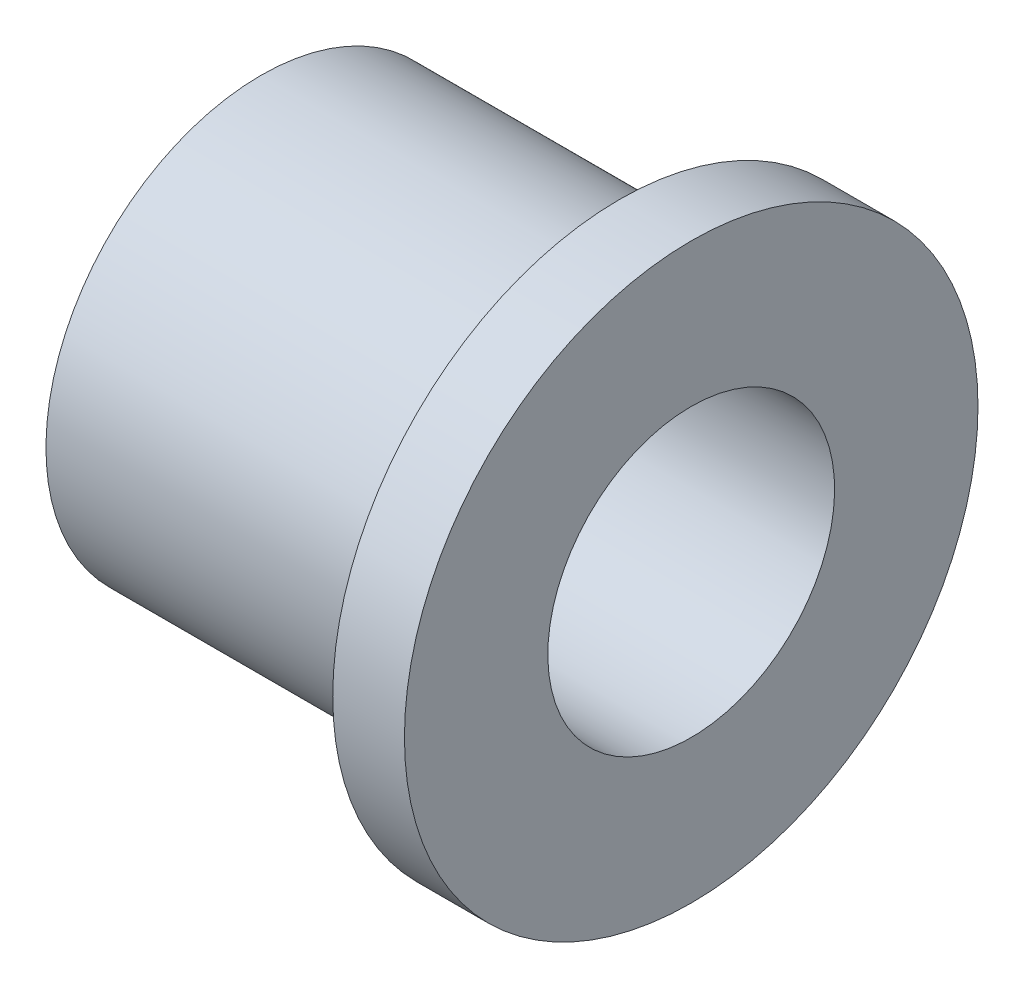
ISO-10303-21;
HEADER;
FILE_DESCRIPTION(('STEP AP214'),'2;1');
FILE_NAME('part.step','',(''),(''),'','','');
FILE_SCHEMA(('AUTOMOTIVE_DESIGN { 1 0 10303 214 1 1 1 1 }'));
ENDSEC;
DATA;
#1=APPLICATION_CONTEXT('core data for automotive mechanical design processes');
#2=APPLICATION_PROTOCOL_DEFINITION('international standard','automotive_design',2000,#1);
#3=PRODUCT_CONTEXT('',#1,'mechanical');
#4=PRODUCT('Part','Part','',(#3));
#5=PRODUCT_RELATED_PRODUCT_CATEGORY('part','',(#4));
#6=PRODUCT_DEFINITION_FORMATION('','',#4);
#7=PRODUCT_DEFINITION_CONTEXT('part definition',#1,'design');
#8=PRODUCT_DEFINITION('design','',#6,#7);
#9=PRODUCT_DEFINITION_SHAPE('','',#8);
#10=(LENGTH_UNIT() NAMED_UNIT(*) SI_UNIT(.MILLI.,.METRE.));
#11=(NAMED_UNIT(*) PLANE_ANGLE_UNIT() SI_UNIT($,.RADIAN.));
#12=(NAMED_UNIT(*) SI_UNIT($,.STERADIAN.) SOLID_ANGLE_UNIT());
#13=UNCERTAINTY_MEASURE_WITH_UNIT(LENGTH_MEASURE(1.E-05),#10,'distance_accuracy_value','');
#14=(GEOMETRIC_REPRESENTATION_CONTEXT(3) GLOBAL_UNCERTAINTY_ASSIGNED_CONTEXT((#13)) GLOBAL_UNIT_ASSIGNED_CONTEXT((#10,
#11,#12)) REPRESENTATION_CONTEXT('',''));
#15=CARTESIAN_POINT('',(0.,0.,0.));
#16=DIRECTION('',(0.,0.,1.));
#17=DIRECTION('',(1.,0.,0.));
#18=AXIS2_PLACEMENT_3D('',#15,#16,#17);
#19=CARTESIAN_POINT('',(-14.777876487,-5.133333334,5.133333334));
#20=DIRECTION('',(1.,0.,0.));
#21=DIRECTION('',(0.,0.,-1.));
#22=AXIS2_PLACEMENT_3D('',#19,#20,#21);
#23=PLANE('',#22);
#24=CARTESIAN_POINT('',(-14.777876487,0.,0.));
#25=DIRECTION('',(1.,0.,0.));
#26=DIRECTION('',(0.,1.,0.));
#27=AXIS2_PLACEMENT_3D('',#24,#25,#26);
#28=CIRCLE('',#27,2.536231885);
#29=CARTESIAN_POINT('',(-14.777876487,2.53623188499999,0.));
#30=VERTEX_POINT('',#29);
#31=EDGE_CURVE('E39',#30,#30,#28,.T.);
#32=ORIENTED_EDGE('',*,*,#31,.F.);
#33=EDGE_LOOP('',(#32));
#34=FACE_BOUND('',#33,.T.);
#35=CARTESIAN_POINT('',(-14.777876487,0.,0.));
#36=DIRECTION('',(1.,0.,0.));
#37=DIRECTION('',(0.,1.,0.));
#38=AXIS2_PLACEMENT_3D('',#35,#36,#37);
#39=CIRCLE('',#38,5.072463769);
#40=CARTESIAN_POINT('',(-14.777876487,5.072463769,0.));
#41=VERTEX_POINT('',#40);
#42=EDGE_CURVE('E17',#41,#41,#39,.T.);
#43=ORIENTED_EDGE('',*,*,#42,.T.);
#44=EDGE_LOOP('',(#43));
#45=FACE_BOUND('',#44,.T.);
#46=ADVANCED_FACE('F13',(#34,#45),#23,.T.);
#47=CARTESIAN_POINT('',(-16.04599243,0.,0.));
#48=DIRECTION('',(1.,0.,0.));
#49=DIRECTION('',(0.,1.,0.));
#50=AXIS2_PLACEMENT_3D('',#47,#48,#49);
#51=CYLINDRICAL_SURFACE('',#50,5.072463769);
#52=CARTESIAN_POINT('',(-16.04599243,0.,0.));
#53=DIRECTION('',(1.,0.,0.));
#54=DIRECTION('',(0.,1.,0.));
#55=AXIS2_PLACEMENT_3D('',#52,#53,#54);
#56=CIRCLE('',#55,5.072463769);
#57=CARTESIAN_POINT('',(-16.04599243,5.072463769,0.));
#58=VERTEX_POINT('',#57);
#59=EDGE_CURVE('E36',#58,#58,#56,.F.);
#60=ORIENTED_EDGE('',*,*,#59,.F.);
#61=EDGE_LOOP('',(#60));
#62=FACE_BOUND('',#61,.T.);
#63=ORIENTED_EDGE('',*,*,#42,.F.);
#64=EDGE_LOOP('',(#63));
#65=FACE_BOUND('',#64,.T.);
#66=ADVANCED_FACE('F48',(#62,#65),#51,.T.);
#67=CARTESIAN_POINT('',(-22.386572141,0.,0.));
#68=DIRECTION('',(1.,0.,0.));
#69=DIRECTION('',(0.,1.,0.));
#70=AXIS2_PLACEMENT_3D('',#67,#68,#69);
#71=CYLINDRICAL_SURFACE('',#70,2.536231885);
#72=ORIENTED_EDGE('',*,*,#31,.T.);
#73=EDGE_LOOP('',(#72));
#74=FACE_BOUND('',#73,.T.);
#75=CARTESIAN_POINT('',(-22.386572141,0.,0.));
#76=DIRECTION('',(1.,0.,0.));
#77=DIRECTION('',(0.,1.,0.));
#78=AXIS2_PLACEMENT_3D('',#75,#76,#77);
#79=CIRCLE('',#78,2.536231885);
#80=CARTESIAN_POINT('',(-22.386572141,2.536231885,0.));
#81=VERTEX_POINT('',#80);
#82=EDGE_CURVE('E31',#81,#81,#79,.T.);
#83=ORIENTED_EDGE('',*,*,#82,.F.);
#84=EDGE_LOOP('',(#83));
#85=FACE_BOUND('',#84,.T.);
#86=ADVANCED_FACE('F50',(#74,#85),#71,.F.);
#87=CARTESIAN_POINT('',(-16.04599243,-5.133333334,-5.133333334));
#88=DIRECTION('',(-1.,0.,0.));
#89=DIRECTION('',(0.,0.,1.));
#90=AXIS2_PLACEMENT_3D('',#87,#88,#89);
#91=PLANE('',#90);
#92=CARTESIAN_POINT('',(-16.04599243,0.,0.));
#93=DIRECTION('',(1.,0.,0.));
#94=DIRECTION('',(0.,1.,0.));
#95=AXIS2_PLACEMENT_3D('',#92,#93,#94);
#96=CIRCLE('',#95,3.804347827);
#97=CARTESIAN_POINT('',(-16.04599243,3.804347827,0.));
#98=VERTEX_POINT('',#97);
#99=EDGE_CURVE('E22',#98,#98,#96,.T.);
#100=ORIENTED_EDGE('',*,*,#99,.T.);
#101=EDGE_LOOP('',(#100));
#102=FACE_BOUND('',#101,.T.);
#103=ORIENTED_EDGE('',*,*,#59,.T.);
#104=EDGE_LOOP('',(#103));
#105=FACE_BOUND('',#104,.T.);
#106=ADVANCED_FACE('F58',(#102,#105),#91,.T.);
#107=CARTESIAN_POINT('',(-22.386572141,-3.850000001,-3.850000001));
#108=DIRECTION('',(-1.,0.,0.));
#109=DIRECTION('',(0.,0.,1.));
#110=AXIS2_PLACEMENT_3D('',#107,#108,#109);
#111=PLANE('',#110);
#112=ORIENTED_EDGE('',*,*,#82,.T.);
#113=EDGE_LOOP('',(#112));
#114=FACE_BOUND('',#113,.T.);
#115=CARTESIAN_POINT('',(-22.386572141,0.,0.));
#116=DIRECTION('',(1.,0.,0.));
#117=DIRECTION('',(0.,1.,0.));
#118=AXIS2_PLACEMENT_3D('',#115,#116,#117);
#119=CIRCLE('',#118,3.804347827);
#120=CARTESIAN_POINT('',(-22.386572141,3.804347827,0.));
#121=VERTEX_POINT('',#120);
#122=EDGE_CURVE('E9',#121,#121,#119,.F.);
#123=ORIENTED_EDGE('',*,*,#122,.T.);
#124=EDGE_LOOP('',(#123));
#125=FACE_BOUND('',#124,.T.);
#126=ADVANCED_FACE('F15',(#114,#125),#111,.T.);
#127=CARTESIAN_POINT('',(-22.386572141,0.,0.));
#128=DIRECTION('',(1.,0.,0.));
#129=DIRECTION('',(0.,1.,0.));
#130=AXIS2_PLACEMENT_3D('',#127,#128,#129);
#131=CYLINDRICAL_SURFACE('',#130,3.804347827);
#132=ORIENTED_EDGE('',*,*,#99,.F.);
#133=EDGE_LOOP('',(#132));
#134=FACE_BOUND('',#133,.T.);
#135=ORIENTED_EDGE('',*,*,#122,.F.);
#136=EDGE_LOOP('',(#135));
#137=FACE_BOUND('',#136,.T.);
#138=ADVANCED_FACE('F63',(#134,#137),#131,.T.);
#139=CLOSED_SHELL('',(#46,#66,#86,#106,#126,#138));
#140=MANIFOLD_SOLID_BREP('B1',#139);
#141=ADVANCED_BREP_SHAPE_REPRESENTATION('',(#18,#140),#14);
#142=SHAPE_DEFINITION_REPRESENTATION(#9,#141);
ENDSEC;
END-ISO-10303-21;
